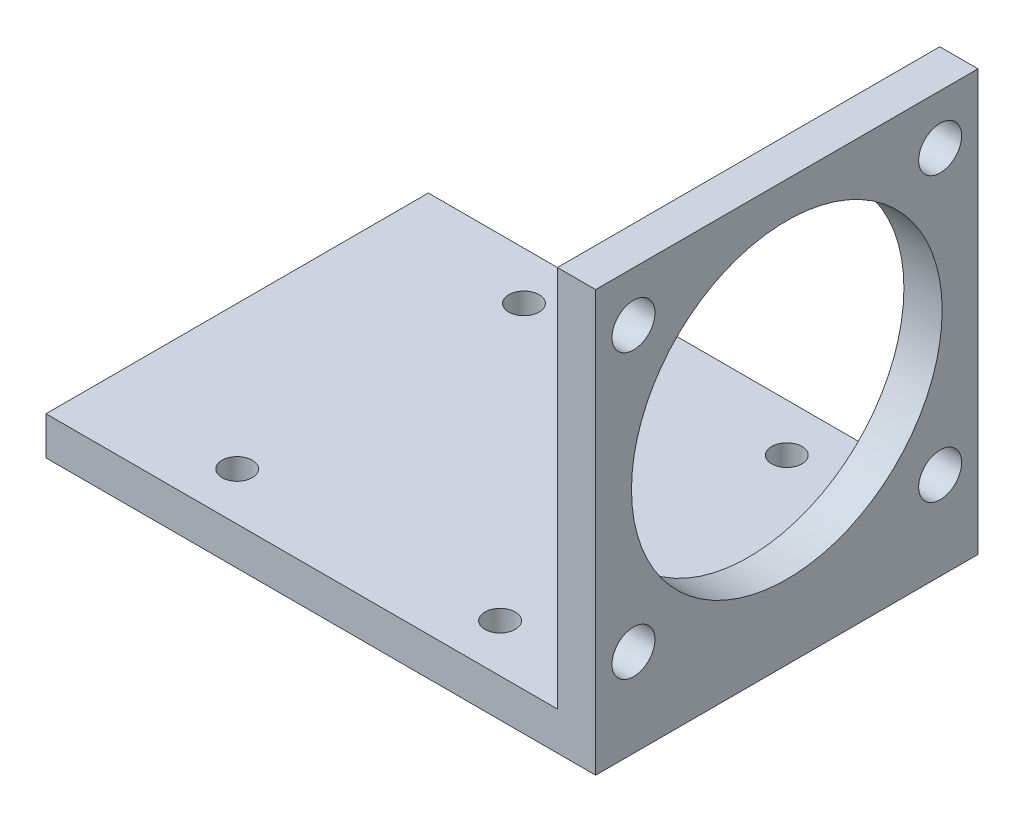
ISO-10303-21;
HEADER;
FILE_DESCRIPTION(('STEP AP214'),'2;1');
FILE_NAME('part.step','',(''),(''),'','','');
FILE_SCHEMA(('AUTOMOTIVE_DESIGN { 1 0 10303 214 1 1 1 1 }'));
ENDSEC;
DATA;
#1=APPLICATION_CONTEXT('core data for automotive mechanical design processes');
#2=APPLICATION_PROTOCOL_DEFINITION('international standard','automotive_design',2000,#1);
#3=PRODUCT_CONTEXT('',#1,'mechanical');
#4=PRODUCT('Part','Part','',(#3));
#5=PRODUCT_RELATED_PRODUCT_CATEGORY('part','',(#4));
#6=PRODUCT_DEFINITION_FORMATION('','',#4);
#7=PRODUCT_DEFINITION_CONTEXT('part definition',#1,'design');
#8=PRODUCT_DEFINITION('design','',#6,#7);
#9=PRODUCT_DEFINITION_SHAPE('','',#8);
#10=(LENGTH_UNIT() NAMED_UNIT(*) SI_UNIT(.MILLI.,.METRE.));
#11=(NAMED_UNIT(*) PLANE_ANGLE_UNIT() SI_UNIT($,.RADIAN.));
#12=(NAMED_UNIT(*) SI_UNIT($,.STERADIAN.) SOLID_ANGLE_UNIT());
#13=UNCERTAINTY_MEASURE_WITH_UNIT(LENGTH_MEASURE(1.E-05),#10,'distance_accuracy_value','');
#14=(GEOMETRIC_REPRESENTATION_CONTEXT(3) GLOBAL_UNCERTAINTY_ASSIGNED_CONTEXT((#13)) GLOBAL_UNIT_ASSIGNED_CONTEXT((#10,
#11,#12)) REPRESENTATION_CONTEXT('',''));
#15=CARTESIAN_POINT('',(0.,0.,0.));
#16=DIRECTION('',(0.,0.,1.));
#17=DIRECTION('',(1.,0.,0.));
#18=AXIS2_PLACEMENT_3D('',#15,#16,#17);
#19=CARTESIAN_POINT('',(-28.75,4.,20.));
#20=DIRECTION('',(1.,0.,0.));
#21=DIRECTION('',(0.,0.,-1.));
#22=AXIS2_PLACEMENT_3D('',#19,#20,#21);
#23=PLANE('',#22);
#24=DIRECTION('',(0.,0.,1.));
#25=VECTOR('',#24,1.);
#26=CARTESIAN_POINT('',(-28.75,0.,20.));
#27=LINE('',#26,#25);
#28=CARTESIAN_POINT('',(-28.75,0.,-20.));
#29=VERTEX_POINT('',#28);
#30=CARTESIAN_POINT('',(-28.75,0.,20.));
#31=VERTEX_POINT('',#30);
#32=EDGE_CURVE('E104',#29,#31,#27,.T.);
#33=ORIENTED_EDGE('',*,*,#32,.T.);
#34=DIRECTION('',(0.,-1.,0.));
#35=VECTOR('',#34,1.);
#36=CARTESIAN_POINT('',(-28.75,4.,20.));
#37=LINE('',#36,#35);
#38=CARTESIAN_POINT('',(-28.75,4.,20.));
#39=VERTEX_POINT('',#38);
#40=EDGE_CURVE('E11',#39,#31,#37,.T.);
#41=ORIENTED_EDGE('',*,*,#40,.F.);
#42=DIRECTION('',(0.,0.,1.));
#43=VECTOR('',#42,1.);
#44=CARTESIAN_POINT('',(-28.75,4.,20.));
#45=LINE('',#44,#43);
#46=CARTESIAN_POINT('',(-28.75,4.,-20.));
#47=VERTEX_POINT('',#46);
#48=EDGE_CURVE('E98',#47,#39,#45,.T.);
#49=ORIENTED_EDGE('',*,*,#48,.F.);
#50=DIRECTION('',(0.,-1.,0.));
#51=VECTOR('',#50,1.);
#52=CARTESIAN_POINT('',(-28.75,4.,-20.));
#53=LINE('',#52,#51);
#54=EDGE_CURVE('E89',#47,#29,#53,.T.);
#55=ORIENTED_EDGE('',*,*,#54,.T.);
#56=EDGE_LOOP('',(#33,#41,#49,#55));
#57=FACE_BOUND('',#56,.T.);
#58=ADVANCED_FACE('F46',(#57),#23,.F.);
#59=CARTESIAN_POINT('',(28.75,4.,20.));
#60=DIRECTION('',(0.,0.,-1.));
#61=DIRECTION('',(-1.,0.,0.));
#62=AXIS2_PLACEMENT_3D('',#59,#60,#61);
#63=PLANE('',#62);
#64=DIRECTION('',(1.,0.,0.));
#65=VECTOR('',#64,1.);
#66=CARTESIAN_POINT('',(28.75,0.,20.));
#67=LINE('',#66,#65);
#68=CARTESIAN_POINT('',(28.75,0.,20.));
#69=VERTEX_POINT('',#68);
#70=EDGE_CURVE('E108',#31,#69,#67,.T.);
#71=ORIENTED_EDGE('',*,*,#70,.T.);
#72=DIRECTION('',(0.,-1.,0.));
#73=VECTOR('',#72,1.);
#74=CARTESIAN_POINT('',(28.75,4.,20.));
#75=LINE('',#74,#73);
#76=CARTESIAN_POINT('',(28.75,44.,20.));
#77=VERTEX_POINT('',#76);
#78=EDGE_CURVE('E54',#77,#69,#75,.T.);
#79=ORIENTED_EDGE('',*,*,#78,.F.);
#80=DIRECTION('',(1.,0.,0.));
#81=VECTOR('',#80,1.);
#82=CARTESIAN_POINT('',(28.75,44.,20.));
#83=LINE('',#82,#81);
#84=CARTESIAN_POINT('',(24.75,44.,20.));
#85=VERTEX_POINT('',#84);
#86=EDGE_CURVE('E138',#85,#77,#83,.T.);
#87=ORIENTED_EDGE('',*,*,#86,.F.);
#88=DIRECTION('',(0.,-1.,0.));
#89=VECTOR('',#88,1.);
#90=CARTESIAN_POINT('',(24.75,44.,20.));
#91=LINE('',#90,#89);
#92=CARTESIAN_POINT('',(24.75,4.,20.));
#93=VERTEX_POINT('',#92);
#94=EDGE_CURVE('E116',#85,#93,#91,.T.);
#95=ORIENTED_EDGE('',*,*,#94,.T.);
#96=DIRECTION('',(1.,0.,0.));
#97=VECTOR('',#96,1.);
#98=CARTESIAN_POINT('',(28.75,4.,20.));
#99=LINE('',#98,#97);
#100=EDGE_CURVE('E161',#39,#93,#99,.T.);
#101=ORIENTED_EDGE('',*,*,#100,.F.);
#102=ORIENTED_EDGE('',*,*,#40,.T.);
#103=EDGE_LOOP('',(#71,#79,#87,#95,#101,#102));
#104=FACE_BOUND('',#103,.T.);
#105=ADVANCED_FACE('F135',(#104),#63,.F.);
#106=CARTESIAN_POINT('',(28.75,4.,20.));
#107=DIRECTION('',(-1.,0.,0.));
#108=DIRECTION('',(0.,0.,1.));
#109=AXIS2_PLACEMENT_3D('',#106,#107,#108);
#110=PLANE('',#109);
#111=CARTESIAN_POINT('',(28.75,24.,0.));
#112=DIRECTION('',(-1.,0.,0.));
#113=DIRECTION('',(0.,0.,1.));
#114=AXIS2_PLACEMENT_3D('',#111,#112,#113);
#115=CIRCLE('',#114,16.25);
#116=CARTESIAN_POINT('',(28.75,24.,16.25));
#117=VERTEX_POINT('',#116);
#118=EDGE_CURVE('E194',#117,#117,#115,.F.);
#119=ORIENTED_EDGE('',*,*,#118,.F.);
#120=EDGE_LOOP('',(#119));
#121=FACE_BOUND('',#120,.T.);
#122=CARTESIAN_POINT('',(28.75,9.2,-16.04));
#123=DIRECTION('',(-1.,0.,0.));
#124=DIRECTION('',(0.,0.,1.));
#125=AXIS2_PLACEMENT_3D('',#122,#123,#124);
#126=CIRCLE('',#125,2.25);
#127=CARTESIAN_POINT('',(28.75,9.2,-13.79));
#128=VERTEX_POINT('',#127);
#129=EDGE_CURVE('E190',#128,#128,#126,.F.);
#130=ORIENTED_EDGE('',*,*,#129,.F.);
#131=EDGE_LOOP('',(#130));
#132=FACE_BOUND('',#131,.T.);
#133=CARTESIAN_POINT('',(28.75,9.2,16.04));
#134=DIRECTION('',(-1.,0.,0.));
#135=DIRECTION('',(0.,0.,1.));
#136=AXIS2_PLACEMENT_3D('',#133,#134,#135);
#137=CIRCLE('',#136,2.25);
#138=CARTESIAN_POINT('',(28.75,9.2,18.29));
#139=VERTEX_POINT('',#138);
#140=EDGE_CURVE('E189',#139,#139,#137,.F.);
#141=ORIENTED_EDGE('',*,*,#140,.F.);
#142=EDGE_LOOP('',(#141));
#143=FACE_BOUND('',#142,.T.);
#144=CARTESIAN_POINT('',(28.75,38.8,16.04));
#145=DIRECTION('',(-1.,0.,0.));
#146=DIRECTION('',(0.,0.,1.));
#147=AXIS2_PLACEMENT_3D('',#144,#145,#146);
#148=CIRCLE('',#147,2.25);
#149=CARTESIAN_POINT('',(28.75,38.8,18.29));
#150=VERTEX_POINT('',#149);
#151=EDGE_CURVE('E199',#150,#150,#148,.F.);
#152=ORIENTED_EDGE('',*,*,#151,.F.);
#153=EDGE_LOOP('',(#152));
#154=FACE_BOUND('',#153,.T.);
#155=CARTESIAN_POINT('',(28.75,38.8,-16.04));
#156=DIRECTION('',(-1.,0.,0.));
#157=DIRECTION('',(0.,0.,1.));
#158=AXIS2_PLACEMENT_3D('',#155,#156,#157);
#159=CIRCLE('',#158,2.25);
#160=CARTESIAN_POINT('',(28.75,38.8,-13.79));
#161=VERTEX_POINT('',#160);
#162=EDGE_CURVE('E158',#161,#161,#159,.F.);
#163=ORIENTED_EDGE('',*,*,#162,.F.);
#164=EDGE_LOOP('',(#163));
#165=FACE_BOUND('',#164,.T.);
#166=DIRECTION('',(0.,0.,-1.));
#167=VECTOR('',#166,1.);
#168=CARTESIAN_POINT('',(28.75,0.,20.));
#169=LINE('',#168,#167);
#170=CARTESIAN_POINT('',(28.75,0.,-20.));
#171=VERTEX_POINT('',#170);
#172=EDGE_CURVE('E99',#69,#171,#169,.T.);
#173=ORIENTED_EDGE('',*,*,#172,.T.);
#174=DIRECTION('',(0.,-1.,0.));
#175=VECTOR('',#174,1.);
#176=CARTESIAN_POINT('',(28.75,4.,-20.));
#177=LINE('',#176,#175);
#178=CARTESIAN_POINT('',(28.75,44.,-20.));
#179=VERTEX_POINT('',#178);
#180=EDGE_CURVE('E93',#179,#171,#177,.T.);
#181=ORIENTED_EDGE('',*,*,#180,.F.);
#182=DIRECTION('',(0.,0.,-1.));
#183=VECTOR('',#182,1.);
#184=CARTESIAN_POINT('',(28.75,44.,-20.));
#185=LINE('',#184,#183);
#186=EDGE_CURVE('E131',#77,#179,#185,.T.);
#187=ORIENTED_EDGE('',*,*,#186,.F.);
#188=ORIENTED_EDGE('',*,*,#78,.T.);
#189=EDGE_LOOP('',(#173,#181,#187,#188));
#190=FACE_BOUND('',#189,.T.);
#191=ADVANCED_FACE('F129',(#121,#132,#143,#154,#165,#190),#110,.F.);
#192=CARTESIAN_POINT('',(28.75,4.,-20.));
#193=DIRECTION('',(0.,0.,1.));
#194=DIRECTION('',(1.,0.,0.));
#195=AXIS2_PLACEMENT_3D('',#192,#193,#194);
#196=PLANE('',#195);
#197=DIRECTION('',(-1.,0.,0.));
#198=VECTOR('',#197,1.);
#199=CARTESIAN_POINT('',(28.75,0.,-20.));
#200=LINE('',#199,#198);
#201=EDGE_CURVE('E86',#171,#29,#200,.T.);
#202=ORIENTED_EDGE('',*,*,#201,.T.);
#203=ORIENTED_EDGE('',*,*,#54,.F.);
#204=DIRECTION('',(-1.,0.,0.));
#205=VECTOR('',#204,1.);
#206=CARTESIAN_POINT('',(28.75,4.,-20.));
#207=LINE('',#206,#205);
#208=CARTESIAN_POINT('',(24.75,4.,-20.));
#209=VERTEX_POINT('',#208);
#210=EDGE_CURVE('E66',#209,#47,#207,.T.);
#211=ORIENTED_EDGE('',*,*,#210,.F.);
#212=DIRECTION('',(0.,-1.,0.));
#213=VECTOR('',#212,1.);
#214=CARTESIAN_POINT('',(24.75,44.,-20.));
#215=LINE('',#214,#213);
#216=CARTESIAN_POINT('',(24.75,44.,-20.));
#217=VERTEX_POINT('',#216);
#218=EDGE_CURVE('E110',#217,#209,#215,.T.);
#219=ORIENTED_EDGE('',*,*,#218,.F.);
#220=DIRECTION('',(-1.,0.,0.));
#221=VECTOR('',#220,1.);
#222=CARTESIAN_POINT('',(28.75,44.,-20.));
#223=LINE('',#222,#221);
#224=EDGE_CURVE('E153',#179,#217,#223,.T.);
#225=ORIENTED_EDGE('',*,*,#224,.F.);
#226=ORIENTED_EDGE('',*,*,#180,.T.);
#227=EDGE_LOOP('',(#202,#203,#211,#219,#225,#226));
#228=FACE_BOUND('',#227,.T.);
#229=ADVANCED_FACE('F88',(#228),#196,.F.);
#230=CARTESIAN_POINT('',(0.,4.,0.));
#231=DIRECTION('',(0.,1.,0.));
#232=DIRECTION('',(0.,0.,1.));
#233=AXIS2_PLACEMENT_3D('',#230,#231,#232);
#234=PLANE('',#233);
#235=CARTESIAN_POINT('',(-13.75,4.,-15.0000000000001));
#236=DIRECTION('',(0.,1.,0.));
#237=DIRECTION('',(0.,0.,1.));
#238=AXIS2_PLACEMENT_3D('',#235,#236,#237);
#239=CIRCLE('',#238,1.585);
#240=CARTESIAN_POINT('',(-13.75,4.,-13.4150000000001));
#241=VERTEX_POINT('',#240);
#242=EDGE_CURVE('E222',#241,#241,#239,.T.);
#243=ORIENTED_EDGE('',*,*,#242,.F.);
#244=EDGE_LOOP('',(#243));
#245=FACE_BOUND('',#244,.T.);
#246=CARTESIAN_POINT('',(13.75,4.,-14.9999999999997));
#247=DIRECTION('',(0.,1.,0.));
#248=DIRECTION('',(0.,0.,1.));
#249=AXIS2_PLACEMENT_3D('',#246,#247,#248);
#250=CIRCLE('',#249,1.58499999999999);
#251=CARTESIAN_POINT('',(13.75,4.,-13.4149999999997));
#252=VERTEX_POINT('',#251);
#253=EDGE_CURVE('E233',#252,#252,#250,.T.);
#254=ORIENTED_EDGE('',*,*,#253,.F.);
#255=EDGE_LOOP('',(#254));
#256=FACE_BOUND('',#255,.T.);
#257=CARTESIAN_POINT('',(-13.75,4.,15.0000000000001));
#258=DIRECTION('',(0.,1.,0.));
#259=DIRECTION('',(0.,0.,1.));
#260=AXIS2_PLACEMENT_3D('',#257,#258,#259);
#261=CIRCLE('',#260,1.585);
#262=CARTESIAN_POINT('',(-13.75,4.,16.5850000000001));
#263=VERTEX_POINT('',#262);
#264=EDGE_CURVE('E226',#263,#263,#261,.F.);
#265=ORIENTED_EDGE('',*,*,#264,.T.);
#266=EDGE_LOOP('',(#265));
#267=FACE_BOUND('',#266,.T.);
#268=CARTESIAN_POINT('',(13.75,4.,14.9999999999997));
#269=DIRECTION('',(0.,1.,0.));
#270=DIRECTION('',(0.,0.,1.));
#271=AXIS2_PLACEMENT_3D('',#268,#269,#270);
#272=CIRCLE('',#271,1.58499999999999);
#273=CARTESIAN_POINT('',(13.75,4.,16.5849999999997));
#274=VERTEX_POINT('',#273);
#275=EDGE_CURVE('E221',#274,#274,#272,.F.);
#276=ORIENTED_EDGE('',*,*,#275,.T.);
#277=EDGE_LOOP('',(#276));
#278=FACE_BOUND('',#277,.T.);
#279=DIRECTION('',(0.,0.,1.));
#280=VECTOR('',#279,1.);
#281=CARTESIAN_POINT('',(24.75,4.,-20.));
#282=LINE('',#281,#280);
#283=EDGE_CURVE('E61',#209,#93,#282,.T.);
#284=ORIENTED_EDGE('',*,*,#283,.F.);
#285=ORIENTED_EDGE('',*,*,#210,.T.);
#286=ORIENTED_EDGE('',*,*,#48,.T.);
#287=ORIENTED_EDGE('',*,*,#100,.T.);
#288=EDGE_LOOP('',(#284,#285,#286,#287));
#289=FACE_BOUND('',#288,.T.);
#290=ADVANCED_FACE('F165',(#245,#256,#267,#278,#289),#234,.T.);
#291=CARTESIAN_POINT('',(0.,0.,0.));
#292=DIRECTION('',(0.,1.,0.));
#293=DIRECTION('',(0.,0.,1.));
#294=AXIS2_PLACEMENT_3D('',#291,#292,#293);
#295=PLANE('',#294);
#296=CARTESIAN_POINT('',(-13.75,0.,-15.0000000000001));
#297=DIRECTION('',(0.,1.,0.));
#298=DIRECTION('',(0.,0.,1.));
#299=AXIS2_PLACEMENT_3D('',#296,#297,#298);
#300=CIRCLE('',#299,1.585);
#301=CARTESIAN_POINT('',(-13.75,0.,-13.4150000000001));
#302=VERTEX_POINT('',#301);
#303=EDGE_CURVE('E237',#302,#302,#300,.T.);
#304=ORIENTED_EDGE('',*,*,#303,.T.);
#305=EDGE_LOOP('',(#304));
#306=FACE_BOUND('',#305,.T.);
#307=CARTESIAN_POINT('',(13.75,0.,-14.9999999999997));
#308=DIRECTION('',(0.,1.,0.));
#309=DIRECTION('',(0.,0.,1.));
#310=AXIS2_PLACEMENT_3D('',#307,#308,#309);
#311=CIRCLE('',#310,1.58499999999999);
#312=CARTESIAN_POINT('',(13.75,0.,-13.4149999999997));
#313=VERTEX_POINT('',#312);
#314=EDGE_CURVE('E238',#313,#313,#311,.T.);
#315=ORIENTED_EDGE('',*,*,#314,.T.);
#316=EDGE_LOOP('',(#315));
#317=FACE_BOUND('',#316,.T.);
#318=CARTESIAN_POINT('',(-13.75,0.,15.0000000000001));
#319=DIRECTION('',(0.,-1.,0.));
#320=DIRECTION('',(0.,0.,-1.));
#321=AXIS2_PLACEMENT_3D('',#318,#319,#320);
#322=CIRCLE('',#321,1.585);
#323=CARTESIAN_POINT('',(-13.75,0.,13.4150000000001));
#324=VERTEX_POINT('',#323);
#325=EDGE_CURVE('E216',#324,#324,#322,.T.);
#326=ORIENTED_EDGE('',*,*,#325,.F.);
#327=EDGE_LOOP('',(#326));
#328=FACE_BOUND('',#327,.T.);
#329=CARTESIAN_POINT('',(13.75,0.,14.9999999999997));
#330=DIRECTION('',(0.,-1.,0.));
#331=DIRECTION('',(0.,0.,-1.));
#332=AXIS2_PLACEMENT_3D('',#329,#330,#331);
#333=CIRCLE('',#332,1.58499999999999);
#334=CARTESIAN_POINT('',(13.75,0.,13.4149999999997));
#335=VERTEX_POINT('',#334);
#336=EDGE_CURVE('E217',#335,#335,#333,.T.);
#337=ORIENTED_EDGE('',*,*,#336,.F.);
#338=EDGE_LOOP('',(#337));
#339=FACE_BOUND('',#338,.T.);
#340=ORIENTED_EDGE('',*,*,#32,.F.);
#341=ORIENTED_EDGE('',*,*,#201,.F.);
#342=ORIENTED_EDGE('',*,*,#172,.F.);
#343=ORIENTED_EDGE('',*,*,#70,.F.);
#344=EDGE_LOOP('',(#340,#341,#342,#343));
#345=FACE_BOUND('',#344,.T.);
#346=ADVANCED_FACE('F107',(#306,#317,#328,#339,#345),#295,.F.);
#347=CARTESIAN_POINT('',(24.75,44.,-20.));
#348=DIRECTION('',(1.,0.,0.));
#349=DIRECTION('',(0.,0.,-1.));
#350=AXIS2_PLACEMENT_3D('',#347,#348,#349);
#351=PLANE('',#350);
#352=CARTESIAN_POINT('',(24.75,24.,0.));
#353=DIRECTION('',(-1.,0.,0.));
#354=DIRECTION('',(0.,0.,1.));
#355=AXIS2_PLACEMENT_3D('',#352,#353,#354);
#356=CIRCLE('',#355,16.25);
#357=CARTESIAN_POINT('',(24.75,24.,16.25));
#358=VERTEX_POINT('',#357);
#359=EDGE_CURVE('E212',#358,#358,#356,.T.);
#360=ORIENTED_EDGE('',*,*,#359,.F.);
#361=EDGE_LOOP('',(#360));
#362=FACE_BOUND('',#361,.T.);
#363=CARTESIAN_POINT('',(24.75,9.2,-16.04));
#364=DIRECTION('',(-1.,0.,0.));
#365=DIRECTION('',(0.,0.,-1.));
#366=AXIS2_PLACEMENT_3D('',#363,#364,#365);
#367=CIRCLE('',#366,2.25);
#368=CARTESIAN_POINT('',(24.75,9.2,-18.29));
#369=VERTEX_POINT('',#368);
#370=EDGE_CURVE('E185',#369,#369,#367,.T.);
#371=ORIENTED_EDGE('',*,*,#370,.F.);
#372=EDGE_LOOP('',(#371));
#373=FACE_BOUND('',#372,.T.);
#374=CARTESIAN_POINT('',(24.75,9.2,16.04));
#375=DIRECTION('',(-1.,0.,0.));
#376=DIRECTION('',(0.,0.,1.));
#377=AXIS2_PLACEMENT_3D('',#374,#375,#376);
#378=CIRCLE('',#377,2.25);
#379=CARTESIAN_POINT('',(24.75,9.2,18.29));
#380=VERTEX_POINT('',#379);
#381=EDGE_CURVE('E195',#380,#380,#378,.T.);
#382=ORIENTED_EDGE('',*,*,#381,.F.);
#383=EDGE_LOOP('',(#382));
#384=FACE_BOUND('',#383,.T.);
#385=CARTESIAN_POINT('',(24.75,38.8,16.04));
#386=DIRECTION('',(-1.,0.,0.));
#387=DIRECTION('',(0.,0.,-1.));
#388=AXIS2_PLACEMENT_3D('',#385,#386,#387);
#389=CIRCLE('',#388,2.25);
#390=CARTESIAN_POINT('',(24.75,38.8,13.79));
#391=VERTEX_POINT('',#390);
#392=EDGE_CURVE('E184',#391,#391,#389,.T.);
#393=ORIENTED_EDGE('',*,*,#392,.F.);
#394=EDGE_LOOP('',(#393));
#395=FACE_BOUND('',#394,.T.);
#396=CARTESIAN_POINT('',(24.75,38.8,-16.04));
#397=DIRECTION('',(-1.,0.,0.));
#398=DIRECTION('',(0.,0.,1.));
#399=AXIS2_PLACEMENT_3D('',#396,#397,#398);
#400=CIRCLE('',#399,2.25);
#401=CARTESIAN_POINT('',(24.75,38.8,-13.79));
#402=VERTEX_POINT('',#401);
#403=EDGE_CURVE('E180',#402,#402,#400,.T.);
#404=ORIENTED_EDGE('',*,*,#403,.F.);
#405=EDGE_LOOP('',(#404));
#406=FACE_BOUND('',#405,.T.);
#407=ORIENTED_EDGE('',*,*,#283,.T.);
#408=ORIENTED_EDGE('',*,*,#94,.F.);
#409=DIRECTION('',(0.,0.,1.));
#410=VECTOR('',#409,1.);
#411=CARTESIAN_POINT('',(24.75,44.,-20.));
#412=LINE('',#411,#410);
#413=EDGE_CURVE('E146',#217,#85,#412,.T.);
#414=ORIENTED_EDGE('',*,*,#413,.F.);
#415=ORIENTED_EDGE('',*,*,#218,.T.);
#416=EDGE_LOOP('',(#407,#408,#414,#415));
#417=FACE_BOUND('',#416,.T.);
#418=ADVANCED_FACE('F167',(#362,#373,#384,#395,#406,#417),#351,.F.);
#419=CARTESIAN_POINT('',(0.,44.,0.));
#420=DIRECTION('',(0.,-1.,0.));
#421=DIRECTION('',(0.,0.,-1.));
#422=AXIS2_PLACEMENT_3D('',#419,#420,#421);
#423=PLANE('',#422);
#424=ORIENTED_EDGE('',*,*,#186,.T.);
#425=ORIENTED_EDGE('',*,*,#224,.T.);
#426=ORIENTED_EDGE('',*,*,#413,.T.);
#427=ORIENTED_EDGE('',*,*,#86,.T.);
#428=EDGE_LOOP('',(#424,#425,#426,#427));
#429=FACE_BOUND('',#428,.T.);
#430=ADVANCED_FACE('F142',(#429),#423,.F.);
#431=CARTESIAN_POINT('',(28.751,38.8,-16.04));
#432=DIRECTION('',(-1.,0.,0.));
#433=DIRECTION('',(0.,0.,1.));
#434=AXIS2_PLACEMENT_3D('',#431,#432,#433);
#435=CYLINDRICAL_SURFACE('',#434,2.25);
#436=ORIENTED_EDGE('',*,*,#403,.T.);
#437=EDGE_LOOP('',(#436));
#438=FACE_BOUND('',#437,.T.);
#439=ORIENTED_EDGE('',*,*,#162,.T.);
#440=EDGE_LOOP('',(#439));
#441=FACE_BOUND('',#440,.T.);
#442=ADVANCED_FACE('F284',(#438,#441),#435,.F.);
#443=CARTESIAN_POINT('',(28.751,38.8,16.04));
#444=DIRECTION('',(-1.,0.,0.));
#445=DIRECTION('',(0.,0.,1.));
#446=AXIS2_PLACEMENT_3D('',#443,#444,#445);
#447=CYLINDRICAL_SURFACE('',#446,2.25);
#448=ORIENTED_EDGE('',*,*,#392,.T.);
#449=EDGE_LOOP('',(#448));
#450=FACE_BOUND('',#449,.T.);
#451=ORIENTED_EDGE('',*,*,#151,.T.);
#452=EDGE_LOOP('',(#451));
#453=FACE_BOUND('',#452,.T.);
#454=ADVANCED_FACE('F287',(#450,#453),#447,.F.);
#455=CARTESIAN_POINT('',(28.751,9.2,16.04));
#456=DIRECTION('',(-1.,0.,0.));
#457=DIRECTION('',(0.,0.,1.));
#458=AXIS2_PLACEMENT_3D('',#455,#456,#457);
#459=CYLINDRICAL_SURFACE('',#458,2.25);
#460=ORIENTED_EDGE('',*,*,#381,.T.);
#461=EDGE_LOOP('',(#460));
#462=FACE_BOUND('',#461,.T.);
#463=ORIENTED_EDGE('',*,*,#140,.T.);
#464=EDGE_LOOP('',(#463));
#465=FACE_BOUND('',#464,.T.);
#466=ADVANCED_FACE('F293',(#462,#465),#459,.F.);
#467=CARTESIAN_POINT('',(28.751,9.2,-16.04));
#468=DIRECTION('',(-1.,0.,0.));
#469=DIRECTION('',(0.,0.,1.));
#470=AXIS2_PLACEMENT_3D('',#467,#468,#469);
#471=CYLINDRICAL_SURFACE('',#470,2.25);
#472=ORIENTED_EDGE('',*,*,#370,.T.);
#473=EDGE_LOOP('',(#472));
#474=FACE_BOUND('',#473,.T.);
#475=ORIENTED_EDGE('',*,*,#129,.T.);
#476=EDGE_LOOP('',(#475));
#477=FACE_BOUND('',#476,.T.);
#478=ADVANCED_FACE('F289',(#474,#477),#471,.F.);
#479=CARTESIAN_POINT('',(28.751,24.,0.));
#480=DIRECTION('',(-1.,0.,0.));
#481=DIRECTION('',(0.,0.,1.));
#482=AXIS2_PLACEMENT_3D('',#479,#480,#481);
#483=CYLINDRICAL_SURFACE('',#482,16.25);
#484=ORIENTED_EDGE('',*,*,#359,.T.);
#485=EDGE_LOOP('',(#484));
#486=FACE_BOUND('',#485,.T.);
#487=ORIENTED_EDGE('',*,*,#118,.T.);
#488=EDGE_LOOP('',(#487));
#489=FACE_BOUND('',#488,.T.);
#490=ADVANCED_FACE('F292',(#486,#489),#483,.F.);
#491=CARTESIAN_POINT('',(13.75,44.001,14.9999999999997));
#492=DIRECTION('',(0.,-1.,0.));
#493=DIRECTION('',(0.,0.,-1.));
#494=AXIS2_PLACEMENT_3D('',#491,#492,#493);
#495=CYLINDRICAL_SURFACE('',#494,1.58499999999999);
#496=ORIENTED_EDGE('',*,*,#275,.F.);
#497=EDGE_LOOP('',(#496));
#498=FACE_BOUND('',#497,.T.);
#499=ORIENTED_EDGE('',*,*,#336,.T.);
#500=EDGE_LOOP('',(#499));
#501=FACE_BOUND('',#500,.T.);
#502=ADVANCED_FACE('F303',(#498,#501),#495,.F.);
#503=CARTESIAN_POINT('',(-13.75,44.001,15.0000000000001));
#504=DIRECTION('',(0.,-1.,0.));
#505=DIRECTION('',(0.,0.,-1.));
#506=AXIS2_PLACEMENT_3D('',#503,#504,#505);
#507=CYLINDRICAL_SURFACE('',#506,1.585);
#508=ORIENTED_EDGE('',*,*,#264,.F.);
#509=EDGE_LOOP('',(#508));
#510=FACE_BOUND('',#509,.T.);
#511=ORIENTED_EDGE('',*,*,#325,.T.);
#512=EDGE_LOOP('',(#511));
#513=FACE_BOUND('',#512,.T.);
#514=ADVANCED_FACE('F259',(#510,#513),#507,.F.);
#515=CARTESIAN_POINT('',(13.75,44.001,-14.9999999999997));
#516=DIRECTION('',(0.,-1.,0.));
#517=DIRECTION('',(0.,0.,-1.));
#518=AXIS2_PLACEMENT_3D('',#515,#516,#517);
#519=CYLINDRICAL_SURFACE('',#518,1.58499999999999);
#520=ORIENTED_EDGE('',*,*,#253,.T.);
#521=EDGE_LOOP('',(#520));
#522=FACE_BOUND('',#521,.T.);
#523=ORIENTED_EDGE('',*,*,#314,.F.);
#524=EDGE_LOOP('',(#523));
#525=FACE_BOUND('',#524,.T.);
#526=ADVANCED_FACE('F253',(#522,#525),#519,.F.);
#527=CARTESIAN_POINT('',(-13.75,44.001,-15.0000000000001));
#528=DIRECTION('',(0.,-1.,0.));
#529=DIRECTION('',(0.,0.,-1.));
#530=AXIS2_PLACEMENT_3D('',#527,#528,#529);
#531=CYLINDRICAL_SURFACE('',#530,1.585);
#532=ORIENTED_EDGE('',*,*,#242,.T.);
#533=EDGE_LOOP('',(#532));
#534=FACE_BOUND('',#533,.T.);
#535=ORIENTED_EDGE('',*,*,#303,.F.);
#536=EDGE_LOOP('',(#535));
#537=FACE_BOUND('',#536,.T.);
#538=ADVANCED_FACE('F251',(#534,#537),#531,.F.);
#539=CLOSED_SHELL('',(#58,#105,#191,#229,#290,#346,#418,#430,#442,#454,#466,#478,#490,#502,#514,
#526,#538));
#540=MANIFOLD_SOLID_BREP('B2',#539);
#541=ADVANCED_BREP_SHAPE_REPRESENTATION('',(#18,#540),#14);
#542=SHAPE_DEFINITION_REPRESENTATION(#9,#541);
ENDSEC;
END-ISO-10303-21;
